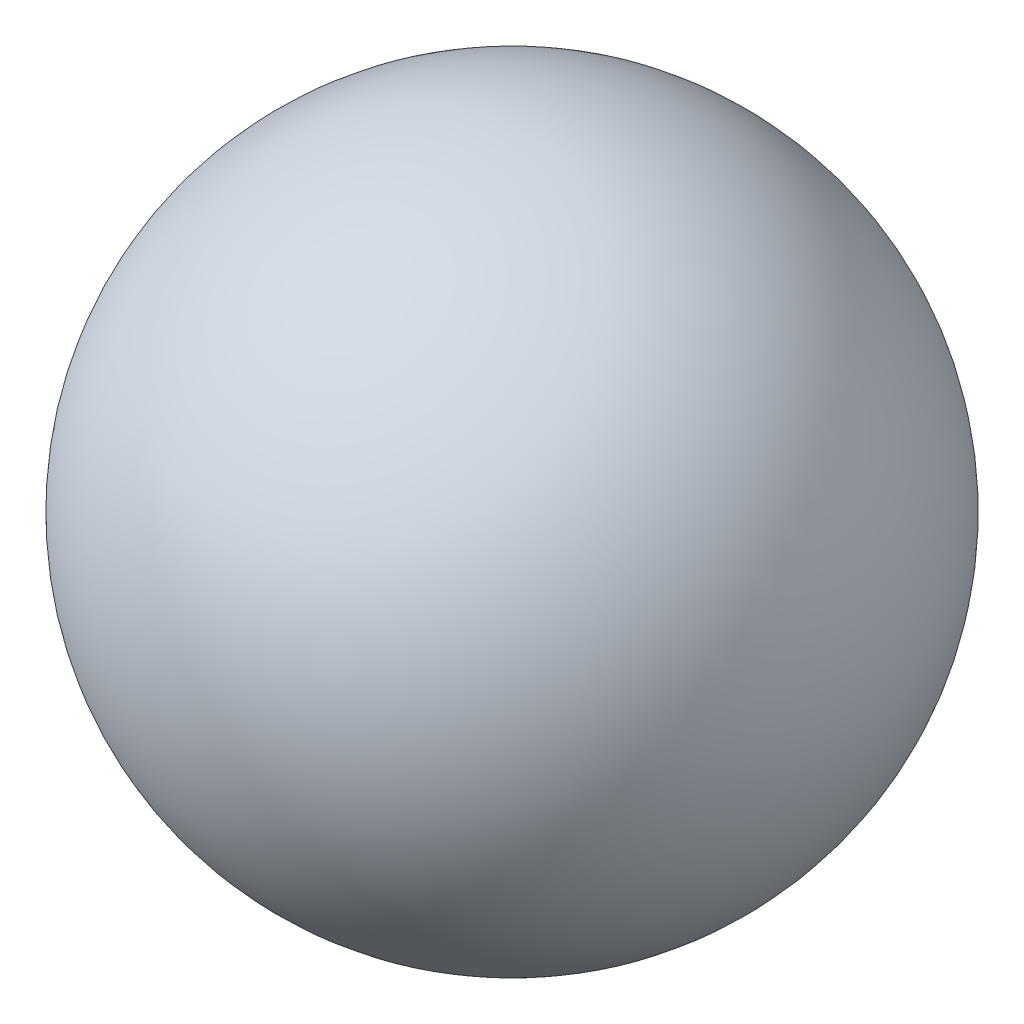
ISO-10303-21;
HEADER;
FILE_DESCRIPTION(('STEP AP214'),'2;1');
FILE_NAME('part.step','',(''),(''),'','','');
FILE_SCHEMA(('AUTOMOTIVE_DESIGN { 1 0 10303 214 1 1 1 1 }'));
ENDSEC;
DATA;
#1=APPLICATION_CONTEXT('core data for automotive mechanical design processes');
#2=APPLICATION_PROTOCOL_DEFINITION('international standard','automotive_design',2000,#1);
#3=PRODUCT_CONTEXT('',#1,'mechanical');
#4=PRODUCT('Part','Part','',(#3));
#5=PRODUCT_RELATED_PRODUCT_CATEGORY('part','',(#4));
#6=PRODUCT_DEFINITION_FORMATION('','',#4);
#7=PRODUCT_DEFINITION_CONTEXT('part definition',#1,'design');
#8=PRODUCT_DEFINITION('design','',#6,#7);
#9=PRODUCT_DEFINITION_SHAPE('','',#8);
#10=(LENGTH_UNIT() NAMED_UNIT(*) SI_UNIT(.MILLI.,.METRE.));
#11=(NAMED_UNIT(*) PLANE_ANGLE_UNIT() SI_UNIT($,.RADIAN.));
#12=(NAMED_UNIT(*) SI_UNIT($,.STERADIAN.) SOLID_ANGLE_UNIT());
#13=UNCERTAINTY_MEASURE_WITH_UNIT(LENGTH_MEASURE(1.E-05),#10,'distance_accuracy_value','');
#14=(GEOMETRIC_REPRESENTATION_CONTEXT(3) GLOBAL_UNCERTAINTY_ASSIGNED_CONTEXT((#13)) GLOBAL_UNIT_ASSIGNED_CONTEXT((#10,
#11,#12)) REPRESENTATION_CONTEXT('',''));
#15=CARTESIAN_POINT('',(0.,0.,0.));
#16=DIRECTION('',(0.,0.,1.));
#17=DIRECTION('',(1.,0.,0.));
#18=AXIS2_PLACEMENT_3D('',#15,#16,#17);
#19=CARTESIAN_POINT('',(0.,0.,0.));
#20=DIRECTION('',(0.,-1.,0.));
#21=DIRECTION('',(0.,0.,1.));
#22=AXIS2_PLACEMENT_3D('',#19,#20,#21);
#23=SPHERICAL_SURFACE('',#22,165.1);
#24=CARTESIAN_POINT('',(0.,-165.1,0.));
#25=VERTEX_POINT('',#24);
#26=VERTEX_LOOP('',#25);
#27=FACE_BOUND('',#26,.T.);
#28=ADVANCED_FACE('F29',(#27),#23,.T.);
#29=CLOSED_SHELL('',(#28));
#30=MANIFOLD_SOLID_BREP('B2',#29);
#31=ADVANCED_BREP_SHAPE_REPRESENTATION('',(#18,#30),#14);
#32=SHAPE_DEFINITION_REPRESENTATION(#9,#31);
ENDSEC;
END-ISO-10303-21;
